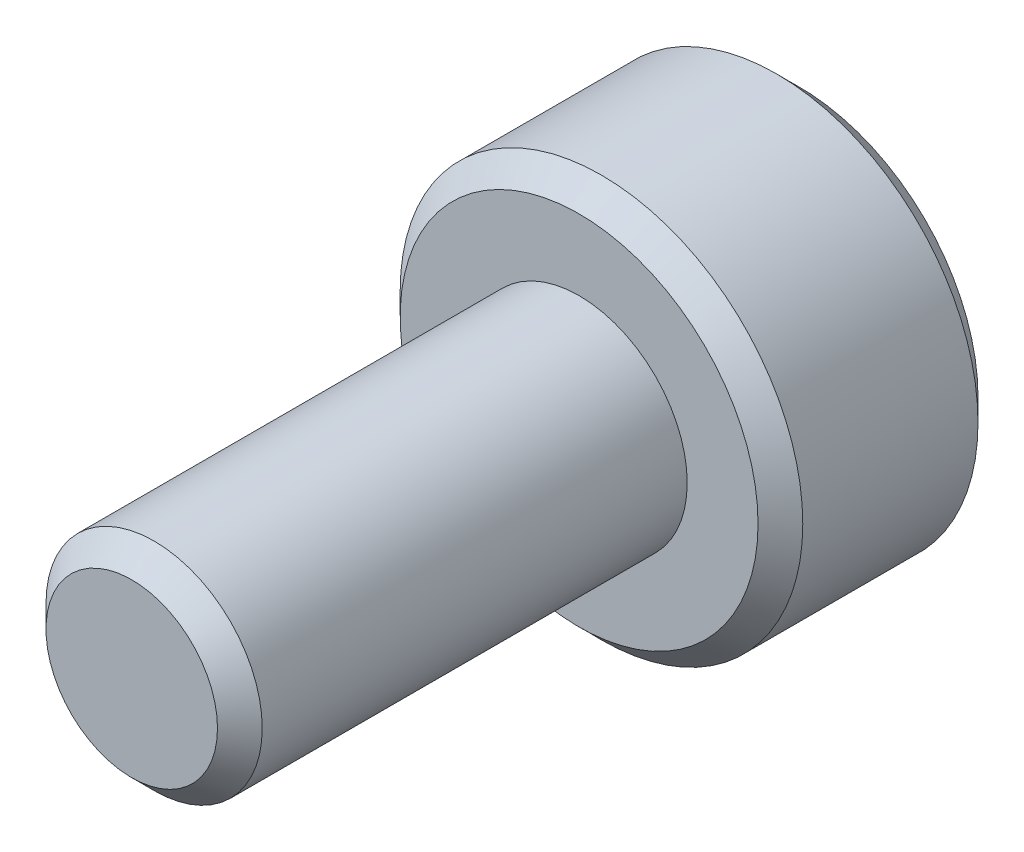
ISO-10303-21;
HEADER;
FILE_DESCRIPTION(('STEP AP214'),'2;1');
FILE_NAME('part.step','',(''),(''),'','','');
FILE_SCHEMA(('AUTOMOTIVE_DESIGN { 1 0 10303 214 1 1 1 1 }'));
ENDSEC;
DATA;
#1=APPLICATION_CONTEXT('core data for automotive mechanical design processes');
#2=APPLICATION_PROTOCOL_DEFINITION('international standard','automotive_design',2000,#1);
#3=PRODUCT_CONTEXT('',#1,'mechanical');
#4=PRODUCT('Part','Part','',(#3));
#5=PRODUCT_RELATED_PRODUCT_CATEGORY('part','',(#4));
#6=PRODUCT_DEFINITION_FORMATION('','',#4);
#7=PRODUCT_DEFINITION_CONTEXT('part definition',#1,'design');
#8=PRODUCT_DEFINITION('design','',#6,#7);
#9=PRODUCT_DEFINITION_SHAPE('','',#8);
#10=(LENGTH_UNIT() NAMED_UNIT(*) SI_UNIT(.MILLI.,.METRE.));
#11=(NAMED_UNIT(*) PLANE_ANGLE_UNIT() SI_UNIT($,.RADIAN.));
#12=(NAMED_UNIT(*) SI_UNIT($,.STERADIAN.) SOLID_ANGLE_UNIT());
#13=UNCERTAINTY_MEASURE_WITH_UNIT(LENGTH_MEASURE(1.E-05),#10,'distance_accuracy_value','');
#14=(GEOMETRIC_REPRESENTATION_CONTEXT(3) GLOBAL_UNCERTAINTY_ASSIGNED_CONTEXT((#13)) GLOBAL_UNIT_ASSIGNED_CONTEXT((#10,
#11,#12)) REPRESENTATION_CONTEXT('',''));
#15=CARTESIAN_POINT('',(0.,0.,0.));
#16=DIRECTION('',(0.,0.,1.));
#17=DIRECTION('',(1.,0.,0.));
#18=AXIS2_PLACEMENT_3D('',#15,#16,#17);
#19=CARTESIAN_POINT('',(0.,0.,2.95));
#20=DIRECTION('',(0.,0.,-1.));
#21=DIRECTION('',(-1.,0.,0.));
#22=AXIS2_PLACEMENT_3D('',#19,#20,#21);
#23=CYLINDRICAL_SURFACE('',#22,2.7);
#24=CARTESIAN_POINT('',(0.,0.,2.65));
#25=DIRECTION('',(0.,0.,1.));
#26=DIRECTION('',(1.,0.,0.));
#27=AXIS2_PLACEMENT_3D('',#24,#25,#26);
#28=CIRCLE('',#27,2.7);
#29=CARTESIAN_POINT('',(2.7,0.,2.65));
#30=VERTEX_POINT('',#29);
#31=EDGE_CURVE('E175',#30,#30,#28,.F.);
#32=ORIENTED_EDGE('',*,*,#31,.T.);
#33=EDGE_LOOP('',(#32));
#34=FACE_BOUND('',#33,.T.);
#35=CARTESIAN_POINT('',(0.,0.,0.300000000000001));
#36=DIRECTION('',(0.,0.,1.));
#37=DIRECTION('',(1.,0.,0.));
#38=AXIS2_PLACEMENT_3D('',#35,#36,#37);
#39=CIRCLE('',#38,2.7);
#40=CARTESIAN_POINT('',(2.7,0.,0.300000000000001));
#41=VERTEX_POINT('',#40);
#42=EDGE_CURVE('E171',#41,#41,#39,.T.);
#43=ORIENTED_EDGE('',*,*,#42,.T.);
#44=EDGE_LOOP('',(#43));
#45=FACE_BOUND('',#44,.T.);
#46=ADVANCED_FACE('F37',(#34,#45),#23,.T.);
#47=CARTESIAN_POINT('',(0.,0.,2.95));
#48=DIRECTION('',(0.,0.,1.));
#49=DIRECTION('',(1.,0.,0.));
#50=AXIS2_PLACEMENT_3D('',#47,#48,#49);
#51=PLANE('',#50);
#52=CARTESIAN_POINT('',(0.,0.,2.95));
#53=DIRECTION('',(0.,0.,1.));
#54=DIRECTION('',(1.,0.,0.));
#55=AXIS2_PLACEMENT_3D('',#52,#53,#54);
#56=CIRCLE('',#55,2.4);
#57=CARTESIAN_POINT('',(2.4,0.,2.95));
#58=VERTEX_POINT('',#57);
#59=EDGE_CURVE('E167',#58,#58,#56,.T.);
#60=ORIENTED_EDGE('',*,*,#59,.T.);
#61=EDGE_LOOP('',(#60));
#62=FACE_BOUND('',#61,.T.);
#63=CARTESIAN_POINT('',(0.,0.,2.95));
#64=DIRECTION('',(0.,0.,1.));
#65=DIRECTION('',(1.,0.,0.));
#66=AXIS2_PLACEMENT_3D('',#63,#64,#65);
#67=CIRCLE('',#66,1.45);
#68=CARTESIAN_POINT('',(1.45,0.,2.95));
#69=VERTEX_POINT('',#68);
#70=EDGE_CURVE('E155',#69,#69,#67,.T.);
#71=ORIENTED_EDGE('',*,*,#70,.F.);
#72=EDGE_LOOP('',(#71));
#73=FACE_BOUND('',#72,.T.);
#74=ADVANCED_FACE('F204',(#62,#73),#51,.T.);
#75=CARTESIAN_POINT('',(0.,0.,0.));
#76=DIRECTION('',(0.,0.,1.));
#77=DIRECTION('',(1.,0.,0.));
#78=AXIS2_PLACEMENT_3D('',#75,#76,#77);
#79=PLANE('',#78);
#80=DIRECTION('',(0.866025403784439,0.5,0.));
#81=VECTOR('',#80,1.);
#82=CARTESIAN_POINT('',(-1.25,0.721687836487032,0.));
#83=LINE('',#82,#81);
#84=CARTESIAN_POINT('',(-1.25,0.721687836487032,0.));
#85=VERTEX_POINT('',#84);
#86=CARTESIAN_POINT('',(0.,1.44337567297406,0.));
#87=VERTEX_POINT('',#86);
#88=EDGE_CURVE('E137',#85,#87,#83,.T.);
#89=ORIENTED_EDGE('',*,*,#88,.F.);
#90=DIRECTION('',(0.,1.,0.));
#91=VECTOR('',#90,1.);
#92=CARTESIAN_POINT('',(-1.25,-0.721687836487032,0.));
#93=LINE('',#92,#91);
#94=CARTESIAN_POINT('',(-1.25,-0.721687836487032,0.));
#95=VERTEX_POINT('',#94);
#96=EDGE_CURVE('E54',#95,#85,#93,.T.);
#97=ORIENTED_EDGE('',*,*,#96,.F.);
#98=DIRECTION('',(-0.866025403784439,0.5,0.));
#99=VECTOR('',#98,1.);
#100=CARTESIAN_POINT('',(0.,-1.44337567297406,0.));
#101=LINE('',#100,#99);
#102=CARTESIAN_POINT('',(0.,-1.44337567297406,0.));
#103=VERTEX_POINT('',#102);
#104=EDGE_CURVE('E149',#103,#95,#101,.T.);
#105=ORIENTED_EDGE('',*,*,#104,.F.);
#106=DIRECTION('',(-0.866025403784439,-0.5,0.));
#107=VECTOR('',#106,1.);
#108=CARTESIAN_POINT('',(1.25,-0.721687836487032,0.));
#109=LINE('',#108,#107);
#110=CARTESIAN_POINT('',(1.25,-0.721687836487032,0.));
#111=VERTEX_POINT('',#110);
#112=EDGE_CURVE('E146',#111,#103,#109,.T.);
#113=ORIENTED_EDGE('',*,*,#112,.F.);
#114=DIRECTION('',(0.,-1.,0.));
#115=VECTOR('',#114,1.);
#116=CARTESIAN_POINT('',(1.25,0.721687836487032,0.));
#117=LINE('',#116,#115);
#118=CARTESIAN_POINT('',(1.25,0.721687836487032,0.));
#119=VERTEX_POINT('',#118);
#120=EDGE_CURVE('E102',#119,#111,#117,.T.);
#121=ORIENTED_EDGE('',*,*,#120,.F.);
#122=DIRECTION('',(0.866025403784439,-0.5,0.));
#123=VECTOR('',#122,1.);
#124=CARTESIAN_POINT('',(0.,1.44337567297406,0.));
#125=LINE('',#124,#123);
#126=EDGE_CURVE('E141',#87,#119,#125,.T.);
#127=ORIENTED_EDGE('',*,*,#126,.F.);
#128=EDGE_LOOP('',(#89,#97,#105,#113,#121,#127));
#129=FACE_BOUND('',#128,.T.);
#130=CARTESIAN_POINT('',(0.,0.,0.));
#131=DIRECTION('',(0.,0.,1.));
#132=DIRECTION('',(1.,0.,0.));
#133=AXIS2_PLACEMENT_3D('',#130,#131,#132);
#134=CIRCLE('',#133,2.4);
#135=CARTESIAN_POINT('',(2.4,0.,0.));
#136=VERTEX_POINT('',#135);
#137=EDGE_CURVE('E179',#136,#136,#134,.F.);
#138=ORIENTED_EDGE('',*,*,#137,.T.);
#139=EDGE_LOOP('',(#138));
#140=FACE_BOUND('',#139,.T.);
#141=ADVANCED_FACE('F210',(#129,#140),#79,.F.);
#142=CARTESIAN_POINT('',(0.,0.,8.95));
#143=DIRECTION('',(0.,0.,-1.));
#144=DIRECTION('',(-1.,0.,0.));
#145=AXIS2_PLACEMENT_3D('',#142,#143,#144);
#146=CYLINDRICAL_SURFACE('',#145,1.45);
#147=CARTESIAN_POINT('',(0.,0.,8.65));
#148=DIRECTION('',(0.,0.,1.));
#149=DIRECTION('',(1.,0.,0.));
#150=AXIS2_PLACEMENT_3D('',#147,#148,#149);
#151=CIRCLE('',#150,1.45);
#152=CARTESIAN_POINT('',(1.45,0.,8.65));
#153=VERTEX_POINT('',#152);
#154=EDGE_CURVE('E11',#153,#153,#151,.F.);
#155=ORIENTED_EDGE('',*,*,#154,.T.);
#156=EDGE_LOOP('',(#155));
#157=FACE_BOUND('',#156,.T.);
#158=ORIENTED_EDGE('',*,*,#70,.T.);
#159=EDGE_LOOP('',(#158));
#160=FACE_BOUND('',#159,.T.);
#161=ADVANCED_FACE('F229',(#157,#160),#146,.T.);
#162=CARTESIAN_POINT('',(0.,0.,8.95));
#163=DIRECTION('',(0.,0.,1.));
#164=DIRECTION('',(1.,0.,0.));
#165=AXIS2_PLACEMENT_3D('',#162,#163,#164);
#166=PLANE('',#165);
#167=CARTESIAN_POINT('',(0.,0.,8.95));
#168=DIRECTION('',(0.,0.,1.));
#169=DIRECTION('',(1.,0.,0.));
#170=AXIS2_PLACEMENT_3D('',#167,#168,#169);
#171=CIRCLE('',#170,1.15);
#172=CARTESIAN_POINT('',(1.15,0.,8.95));
#173=VERTEX_POINT('',#172);
#174=EDGE_CURVE('E47',#173,#173,#171,.T.);
#175=ORIENTED_EDGE('',*,*,#174,.T.);
#176=EDGE_LOOP('',(#175));
#177=FACE_BOUND('',#176,.T.);
#178=ADVANCED_FACE('F188',(#177),#166,.T.);
#179=CARTESIAN_POINT('',(0.,0.,2.95));
#180=DIRECTION('',(0.,0.,-1.));
#181=DIRECTION('',(-1.,0.,0.));
#182=AXIS2_PLACEMENT_3D('',#179,#180,#181);
#183=CONICAL_SURFACE('',#182,2.4,0.785398163397446);
#184=ORIENTED_EDGE('',*,*,#31,.F.);
#185=EDGE_LOOP('',(#184));
#186=FACE_BOUND('',#185,.T.);
#187=ORIENTED_EDGE('',*,*,#59,.F.);
#188=EDGE_LOOP('',(#187));
#189=FACE_BOUND('',#188,.T.);
#190=ADVANCED_FACE('F200',(#186,#189),#183,.T.);
#191=CARTESIAN_POINT('',(0.,0.,0.300000000000001));
#192=DIRECTION('',(0.,0.,1.));
#193=DIRECTION('',(1.,0.,0.));
#194=AXIS2_PLACEMENT_3D('',#191,#192,#193);
#195=CONICAL_SURFACE('',#194,2.7,0.785398163397447);
#196=ORIENTED_EDGE('',*,*,#137,.F.);
#197=EDGE_LOOP('',(#196));
#198=FACE_BOUND('',#197,.T.);
#199=ORIENTED_EDGE('',*,*,#42,.F.);
#200=EDGE_LOOP('',(#199));
#201=FACE_BOUND('',#200,.T.);
#202=ADVANCED_FACE('F192',(#198,#201),#195,.T.);
#203=CARTESIAN_POINT('',(0.,0.,8.95));
#204=DIRECTION('',(0.,0.,-1.));
#205=DIRECTION('',(-1.,0.,0.));
#206=AXIS2_PLACEMENT_3D('',#203,#204,#205);
#207=CONICAL_SURFACE('',#206,1.15,0.785398163397445);
#208=ORIENTED_EDGE('',*,*,#154,.F.);
#209=EDGE_LOOP('',(#208));
#210=FACE_BOUND('',#209,.T.);
#211=ORIENTED_EDGE('',*,*,#174,.F.);
#212=EDGE_LOOP('',(#211));
#213=FACE_BOUND('',#212,.T.);
#214=ADVANCED_FACE('F40',(#210,#213),#207,.T.);
#215=CARTESIAN_POINT('',(-1.25,-0.721687836487032,2.5));
#216=DIRECTION('',(-1.,0.,0.));
#217=DIRECTION('',(0.,-1.,0.));
#218=AXIS2_PLACEMENT_3D('',#215,#216,#217);
#219=PLANE('',#218);
#220=ORIENTED_EDGE('',*,*,#96,.T.);
#221=DIRECTION('',(0.,0.,-1.));
#222=VECTOR('',#221,1.);
#223=CARTESIAN_POINT('',(-1.25,0.721687836487032,2.5));
#224=LINE('',#223,#222);
#225=CARTESIAN_POINT('',(-1.25,0.721687836487032,2.5));
#226=VERTEX_POINT('',#225);
#227=EDGE_CURVE('E84',#226,#85,#224,.T.);
#228=ORIENTED_EDGE('',*,*,#227,.F.);
#229=DIRECTION('',(0.,1.,0.));
#230=VECTOR('',#229,1.);
#231=CARTESIAN_POINT('',(-1.25,-0.721687836487032,2.5));
#232=LINE('',#231,#230);
#233=CARTESIAN_POINT('',(-1.25,-0.721687836487032,2.5));
#234=VERTEX_POINT('',#233);
#235=EDGE_CURVE('E152',#234,#226,#232,.T.);
#236=ORIENTED_EDGE('',*,*,#235,.F.);
#237=DIRECTION('',(0.,0.,-1.));
#238=VECTOR('',#237,1.);
#239=CARTESIAN_POINT('',(-1.25,-0.721687836487032,2.5));
#240=LINE('',#239,#238);
#241=EDGE_CURVE('E62',#234,#95,#240,.T.);
#242=ORIENTED_EDGE('',*,*,#241,.T.);
#243=EDGE_LOOP('',(#220,#228,#236,#242));
#244=FACE_BOUND('',#243,.T.);
#245=ADVANCED_FACE('F191',(#244),#219,.F.);
#246=CARTESIAN_POINT('',(0.,-1.44337567297406,2.5));
#247=DIRECTION('',(-0.5,-0.866025403784439,0.));
#248=DIRECTION('',(0.866025403784439,-0.5,0.));
#249=AXIS2_PLACEMENT_3D('',#246,#247,#248);
#250=PLANE('',#249);
#251=ORIENTED_EDGE('',*,*,#104,.T.);
#252=ORIENTED_EDGE('',*,*,#241,.F.);
#253=DIRECTION('',(-0.866025403784439,0.5,0.));
#254=VECTOR('',#253,1.);
#255=CARTESIAN_POINT('',(0.,-1.44337567297406,2.5));
#256=LINE('',#255,#254);
#257=CARTESIAN_POINT('',(0.,-1.44337567297406,2.5));
#258=VERTEX_POINT('',#257);
#259=EDGE_CURVE('E116',#258,#234,#256,.T.);
#260=ORIENTED_EDGE('',*,*,#259,.F.);
#261=DIRECTION('',(0.,0.,-1.));
#262=VECTOR('',#261,1.);
#263=CARTESIAN_POINT('',(0.,-1.44337567297406,2.5));
#264=LINE('',#263,#262);
#265=EDGE_CURVE('E107',#258,#103,#264,.T.);
#266=ORIENTED_EDGE('',*,*,#265,.T.);
#267=EDGE_LOOP('',(#251,#252,#260,#266));
#268=FACE_BOUND('',#267,.T.);
#269=ADVANCED_FACE('F198',(#268),#250,.F.);
#270=CARTESIAN_POINT('',(1.25,-0.721687836487032,2.5));
#271=DIRECTION('',(0.5,-0.866025403784439,0.));
#272=DIRECTION('',(0.866025403784439,0.5,0.));
#273=AXIS2_PLACEMENT_3D('',#270,#271,#272);
#274=PLANE('',#273);
#275=ORIENTED_EDGE('',*,*,#112,.T.);
#276=ORIENTED_EDGE('',*,*,#265,.F.);
#277=DIRECTION('',(-0.866025403784439,-0.5,0.));
#278=VECTOR('',#277,1.);
#279=CARTESIAN_POINT('',(1.25,-0.721687836487032,2.5));
#280=LINE('',#279,#278);
#281=CARTESIAN_POINT('',(1.25,-0.721687836487032,2.5));
#282=VERTEX_POINT('',#281);
#283=EDGE_CURVE('E111',#282,#258,#280,.T.);
#284=ORIENTED_EDGE('',*,*,#283,.F.);
#285=DIRECTION('',(0.,0.,-1.));
#286=VECTOR('',#285,1.);
#287=CARTESIAN_POINT('',(1.25,-0.721687836487032,2.5));
#288=LINE('',#287,#286);
#289=EDGE_CURVE('E95',#282,#111,#288,.T.);
#290=ORIENTED_EDGE('',*,*,#289,.T.);
#291=EDGE_LOOP('',(#275,#276,#284,#290));
#292=FACE_BOUND('',#291,.T.);
#293=ADVANCED_FACE('F112',(#292),#274,.F.);
#294=CARTESIAN_POINT('',(1.25,0.721687836487032,2.5));
#295=DIRECTION('',(1.,0.,0.));
#296=DIRECTION('',(0.,1.,0.));
#297=AXIS2_PLACEMENT_3D('',#294,#295,#296);
#298=PLANE('',#297);
#299=ORIENTED_EDGE('',*,*,#120,.T.);
#300=ORIENTED_EDGE('',*,*,#289,.F.);
#301=DIRECTION('',(0.,-1.,0.));
#302=VECTOR('',#301,1.);
#303=CARTESIAN_POINT('',(1.25,0.721687836487032,2.5));
#304=LINE('',#303,#302);
#305=CARTESIAN_POINT('',(1.25,0.721687836487032,2.5));
#306=VERTEX_POINT('',#305);
#307=EDGE_CURVE('E99',#306,#282,#304,.T.);
#308=ORIENTED_EDGE('',*,*,#307,.F.);
#309=DIRECTION('',(0.,0.,-1.));
#310=VECTOR('',#309,1.);
#311=CARTESIAN_POINT('',(1.25,0.721687836487032,2.5));
#312=LINE('',#311,#310);
#313=EDGE_CURVE('E108',#306,#119,#312,.T.);
#314=ORIENTED_EDGE('',*,*,#313,.T.);
#315=EDGE_LOOP('',(#299,#300,#308,#314));
#316=FACE_BOUND('',#315,.T.);
#317=ADVANCED_FACE('F97',(#316),#298,.F.);
#318=CARTESIAN_POINT('',(0.,1.44337567297406,2.5));
#319=DIRECTION('',(0.5,0.866025403784438,0.));
#320=DIRECTION('',(-0.866025403784439,0.5,0.));
#321=AXIS2_PLACEMENT_3D('',#318,#319,#320);
#322=PLANE('',#321);
#323=ORIENTED_EDGE('',*,*,#126,.T.);
#324=ORIENTED_EDGE('',*,*,#313,.F.);
#325=DIRECTION('',(0.866025403784439,-0.5,0.));
#326=VECTOR('',#325,1.);
#327=CARTESIAN_POINT('',(0.,1.44337567297406,2.5));
#328=LINE('',#327,#326);
#329=CARTESIAN_POINT('',(0.,1.44337567297406,2.5));
#330=VERTEX_POINT('',#329);
#331=EDGE_CURVE('E122',#330,#306,#328,.T.);
#332=ORIENTED_EDGE('',*,*,#331,.F.);
#333=DIRECTION('',(0.,0.,-1.));
#334=VECTOR('',#333,1.);
#335=CARTESIAN_POINT('',(0.,1.44337567297406,2.5));
#336=LINE('',#335,#334);
#337=EDGE_CURVE('E159',#330,#87,#336,.T.);
#338=ORIENTED_EDGE('',*,*,#337,.T.);
#339=EDGE_LOOP('',(#323,#324,#332,#338));
#340=FACE_BOUND('',#339,.T.);
#341=ADVANCED_FACE('F248',(#340),#322,.F.);
#342=CARTESIAN_POINT('',(-1.25,0.721687836487032,2.5));
#343=DIRECTION('',(-0.5,0.866025403784439,0.));
#344=DIRECTION('',(-0.866025403784439,-0.5,0.));
#345=AXIS2_PLACEMENT_3D('',#342,#343,#344);
#346=PLANE('',#345);
#347=ORIENTED_EDGE('',*,*,#88,.T.);
#348=ORIENTED_EDGE('',*,*,#337,.F.);
#349=DIRECTION('',(0.866025403784439,0.5,0.));
#350=VECTOR('',#349,1.);
#351=CARTESIAN_POINT('',(-1.25,0.721687836487032,2.5));
#352=LINE('',#351,#350);
#353=EDGE_CURVE('E129',#226,#330,#352,.T.);
#354=ORIENTED_EDGE('',*,*,#353,.F.);
#355=ORIENTED_EDGE('',*,*,#227,.T.);
#356=EDGE_LOOP('',(#347,#348,#354,#355));
#357=FACE_BOUND('',#356,.T.);
#358=ADVANCED_FACE('F245',(#357),#346,.F.);
#359=CARTESIAN_POINT('',(0.,0.,2.5));
#360=DIRECTION('',(0.,0.,-1.));
#361=DIRECTION('',(-1.,0.,0.));
#362=AXIS2_PLACEMENT_3D('',#359,#360,#361);
#363=PLANE('',#362);
#364=ORIENTED_EDGE('',*,*,#235,.T.);
#365=ORIENTED_EDGE('',*,*,#353,.T.);
#366=ORIENTED_EDGE('',*,*,#331,.T.);
#367=ORIENTED_EDGE('',*,*,#307,.T.);
#368=ORIENTED_EDGE('',*,*,#283,.T.);
#369=ORIENTED_EDGE('',*,*,#259,.T.);
#370=EDGE_LOOP('',(#364,#365,#366,#367,#368,#369));
#371=FACE_BOUND('',#370,.T.);
#372=ADVANCED_FACE('F119',(#371),#363,.T.);
#373=CLOSED_SHELL('',(#46,#74,#141,#161,#178,#190,#202,#214,#245,#269,#293,#317,#341,#358,#372));
#374=MANIFOLD_SOLID_BREP('B2',#373);
#375=ADVANCED_BREP_SHAPE_REPRESENTATION('',(#18,#374),#14);
#376=SHAPE_DEFINITION_REPRESENTATION(#9,#375);
ENDSEC;
END-ISO-10303-21;
